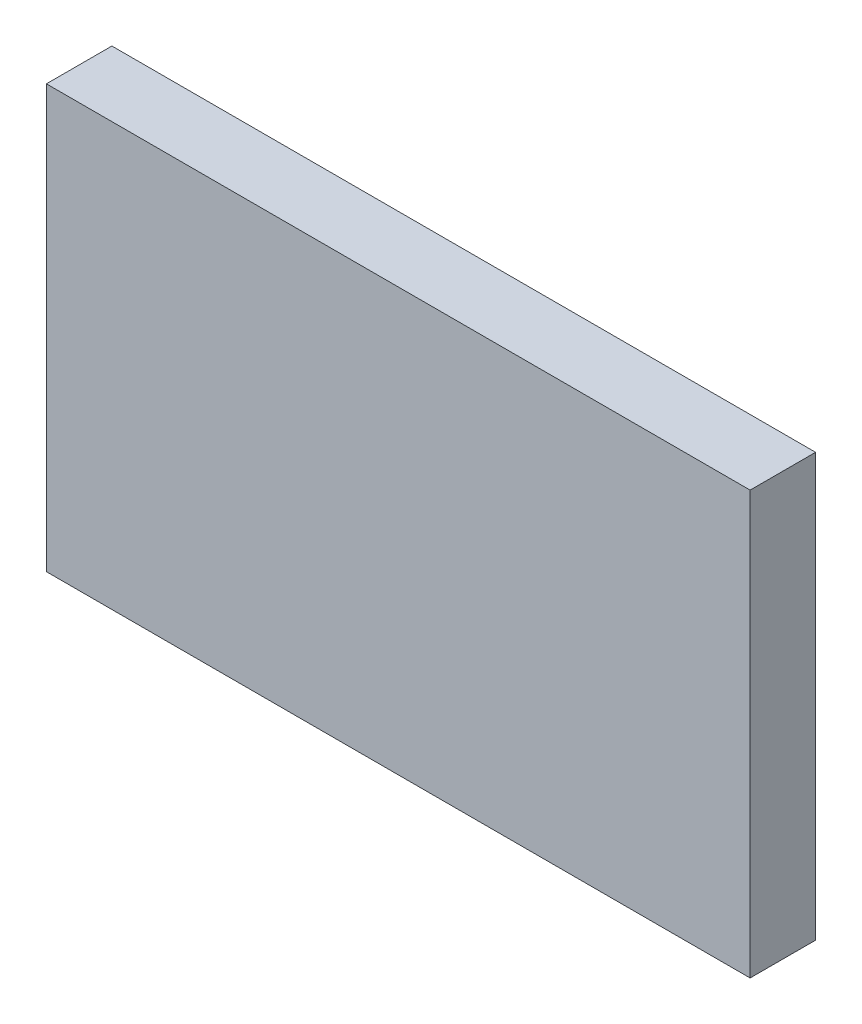
ISO-10303-21;
HEADER;
FILE_DESCRIPTION(('STEP AP214'),'2;1');
FILE_NAME('part.step','',(''),(''),'','','');
FILE_SCHEMA(('AUTOMOTIVE_DESIGN { 1 0 10303 214 1 1 1 1 }'));
ENDSEC;
DATA;
#1=APPLICATION_CONTEXT('core data for automotive mechanical design processes');
#2=APPLICATION_PROTOCOL_DEFINITION('international standard','automotive_design',2000,#1);
#3=PRODUCT_CONTEXT('',#1,'mechanical');
#4=PRODUCT('Part','Part','',(#3));
#5=PRODUCT_RELATED_PRODUCT_CATEGORY('part','',(#4));
#6=PRODUCT_DEFINITION_FORMATION('','',#4);
#7=PRODUCT_DEFINITION_CONTEXT('part definition',#1,'design');
#8=PRODUCT_DEFINITION('design','',#6,#7);
#9=PRODUCT_DEFINITION_SHAPE('','',#8);
#10=(LENGTH_UNIT() NAMED_UNIT(*) SI_UNIT(.MILLI.,.METRE.));
#11=(NAMED_UNIT(*) PLANE_ANGLE_UNIT() SI_UNIT($,.RADIAN.));
#12=(NAMED_UNIT(*) SI_UNIT($,.STERADIAN.) SOLID_ANGLE_UNIT());
#13=UNCERTAINTY_MEASURE_WITH_UNIT(LENGTH_MEASURE(1.E-05),#10,'distance_accuracy_value','');
#14=(GEOMETRIC_REPRESENTATION_CONTEXT(3) GLOBAL_UNCERTAINTY_ASSIGNED_CONTEXT((#13)) GLOBAL_UNIT_ASSIGNED_CONTEXT((#10,
#11,#12)) REPRESENTATION_CONTEXT('',''));
#15=CARTESIAN_POINT('',(0.,0.,0.));
#16=DIRECTION('',(0.,0.,1.));
#17=DIRECTION('',(1.,0.,0.));
#18=AXIS2_PLACEMENT_3D('',#15,#16,#17);
#19=CARTESIAN_POINT('',(-59.2864238582124,30.3230337078652,10.));
#20=DIRECTION('',(1.,0.,0.));
#21=DIRECTION('',(0.,0.,-1.));
#22=AXIS2_PLACEMENT_3D('',#19,#20,#21);
#23=PLANE('',#22);
#24=DIRECTION('',(0.,-1.,0.));
#25=VECTOR('',#24,1.);
#26=CARTESIAN_POINT('',(-59.2864238582124,30.3230337078652,0.));
#27=LINE('',#26,#25);
#28=CARTESIAN_POINT('',(-59.2864238582124,30.3230337078652,0.));
#29=VERTEX_POINT('',#28);
#30=CARTESIAN_POINT('',(-59.2864238582124,-34.2043820224719,0.));
#31=VERTEX_POINT('',#30);
#32=EDGE_CURVE('E96',#29,#31,#27,.T.);
#33=ORIENTED_EDGE('',*,*,#32,.T.);
#34=DIRECTION('',(0.,0.,-1.));
#35=VECTOR('',#34,1.);
#36=CARTESIAN_POINT('',(-59.2864238582124,-34.2043820224719,10.));
#37=LINE('',#36,#35);
#38=CARTESIAN_POINT('',(-59.2864238582124,-34.2043820224719,10.));
#39=VERTEX_POINT('',#38);
#40=EDGE_CURVE('E11',#39,#31,#37,.T.);
#41=ORIENTED_EDGE('',*,*,#40,.F.);
#42=DIRECTION('',(0.,-1.,0.));
#43=VECTOR('',#42,1.);
#44=CARTESIAN_POINT('',(-59.2864238582124,30.3230337078652,10.));
#45=LINE('',#44,#43);
#46=CARTESIAN_POINT('',(-59.2864238582124,30.3230337078652,10.));
#47=VERTEX_POINT('',#46);
#48=EDGE_CURVE('E84',#47,#39,#45,.T.);
#49=ORIENTED_EDGE('',*,*,#48,.F.);
#50=DIRECTION('',(0.,0.,-1.));
#51=VECTOR('',#50,1.);
#52=CARTESIAN_POINT('',(-59.2864238582124,30.3230337078652,10.));
#53=LINE('',#52,#51);
#54=EDGE_CURVE('E92',#47,#29,#53,.T.);
#55=ORIENTED_EDGE('',*,*,#54,.T.);
#56=EDGE_LOOP('',(#33,#41,#49,#55));
#57=FACE_BOUND('',#56,.T.);
#58=ADVANCED_FACE('F33',(#57),#23,.F.);
#59=CARTESIAN_POINT('',(-59.2864238582124,-34.2043820224719,10.));
#60=DIRECTION('',(0.,1.,0.));
#61=DIRECTION('',(0.,0.,1.));
#62=AXIS2_PLACEMENT_3D('',#59,#60,#61);
#63=PLANE('',#62);
#64=DIRECTION('',(1.,0.,0.));
#65=VECTOR('',#64,1.);
#66=CARTESIAN_POINT('',(-59.2864238582124,-34.2043820224719,0.));
#67=LINE('',#66,#65);
#68=CARTESIAN_POINT('',(48.1784076024618,-34.2043820224719,0.));
#69=VERTEX_POINT('',#68);
#70=EDGE_CURVE('E88',#31,#69,#67,.T.);
#71=ORIENTED_EDGE('',*,*,#70,.T.);
#72=DIRECTION('',(0.,0.,-1.));
#73=VECTOR('',#72,1.);
#74=CARTESIAN_POINT('',(48.1784076024618,-34.2043820224719,10.));
#75=LINE('',#74,#73);
#76=CARTESIAN_POINT('',(48.1784076024618,-34.2043820224719,10.));
#77=VERTEX_POINT('',#76);
#78=EDGE_CURVE('E41',#77,#69,#75,.T.);
#79=ORIENTED_EDGE('',*,*,#78,.F.);
#80=DIRECTION('',(1.,0.,0.));
#81=VECTOR('',#80,1.);
#82=CARTESIAN_POINT('',(-59.2864238582124,-34.2043820224719,10.));
#83=LINE('',#82,#81);
#84=EDGE_CURVE('E79',#39,#77,#83,.T.);
#85=ORIENTED_EDGE('',*,*,#84,.F.);
#86=ORIENTED_EDGE('',*,*,#40,.T.);
#87=EDGE_LOOP('',(#71,#79,#85,#86));
#88=FACE_BOUND('',#87,.T.);
#89=ADVANCED_FACE('F87',(#88),#63,.F.);
#90=CARTESIAN_POINT('',(48.1784076024618,30.3230337078652,10.));
#91=DIRECTION('',(-1.,0.,0.));
#92=DIRECTION('',(0.,0.,1.));
#93=AXIS2_PLACEMENT_3D('',#90,#91,#92);
#94=PLANE('',#93);
#95=DIRECTION('',(0.,1.,0.));
#96=VECTOR('',#95,1.);
#97=CARTESIAN_POINT('',(48.1784076024618,30.3230337078652,0.));
#98=LINE('',#97,#96);
#99=CARTESIAN_POINT('',(48.1784076024618,30.3230337078652,0.));
#100=VERTEX_POINT('',#99);
#101=EDGE_CURVE('E66',#69,#100,#98,.T.);
#102=ORIENTED_EDGE('',*,*,#101,.T.);
#103=DIRECTION('',(0.,0.,-1.));
#104=VECTOR('',#103,1.);
#105=CARTESIAN_POINT('',(48.1784076024618,30.3230337078652,10.));
#106=LINE('',#105,#104);
#107=CARTESIAN_POINT('',(48.1784076024618,30.3230337078652,10.));
#108=VERTEX_POINT('',#107);
#109=EDGE_CURVE('E89',#108,#100,#106,.T.);
#110=ORIENTED_EDGE('',*,*,#109,.F.);
#111=DIRECTION('',(0.,1.,0.));
#112=VECTOR('',#111,1.);
#113=CARTESIAN_POINT('',(48.1784076024618,30.3230337078652,10.));
#114=LINE('',#113,#112);
#115=EDGE_CURVE('E82',#77,#108,#114,.T.);
#116=ORIENTED_EDGE('',*,*,#115,.F.);
#117=ORIENTED_EDGE('',*,*,#78,.T.);
#118=EDGE_LOOP('',(#102,#110,#116,#117));
#119=FACE_BOUND('',#118,.T.);
#120=ADVANCED_FACE('F90',(#119),#94,.F.);
#121=CARTESIAN_POINT('',(-59.2864238582124,30.3230337078652,10.));
#122=DIRECTION('',(0.,-1.,0.));
#123=DIRECTION('',(0.,0.,-1.));
#124=AXIS2_PLACEMENT_3D('',#121,#122,#123);
#125=PLANE('',#124);
#126=DIRECTION('',(-1.,0.,0.));
#127=VECTOR('',#126,1.);
#128=CARTESIAN_POINT('',(-59.2864238582124,30.3230337078652,0.));
#129=LINE('',#128,#127);
#130=EDGE_CURVE('E72',#100,#29,#129,.T.);
#131=ORIENTED_EDGE('',*,*,#130,.T.);
#132=ORIENTED_EDGE('',*,*,#54,.F.);
#133=DIRECTION('',(-1.,0.,0.));
#134=VECTOR('',#133,1.);
#135=CARTESIAN_POINT('',(-59.2864238582124,30.3230337078652,10.));
#136=LINE('',#135,#134);
#137=EDGE_CURVE('E49',#108,#47,#136,.T.);
#138=ORIENTED_EDGE('',*,*,#137,.F.);
#139=ORIENTED_EDGE('',*,*,#109,.T.);
#140=EDGE_LOOP('',(#131,#132,#138,#139));
#141=FACE_BOUND('',#140,.T.);
#142=ADVANCED_FACE('F103',(#141),#125,.F.);
#143=CARTESIAN_POINT('',(0.,0.,10.));
#144=DIRECTION('',(0.,0.,1.));
#145=DIRECTION('',(1.,0.,0.));
#146=AXIS2_PLACEMENT_3D('',#143,#144,#145);
#147=PLANE('',#146);
#148=ORIENTED_EDGE('',*,*,#48,.T.);
#149=ORIENTED_EDGE('',*,*,#84,.T.);
#150=ORIENTED_EDGE('',*,*,#115,.T.);
#151=ORIENTED_EDGE('',*,*,#137,.T.);
#152=EDGE_LOOP('',(#148,#149,#150,#151));
#153=FACE_BOUND('',#152,.T.);
#154=ADVANCED_FACE('F80',(#153),#147,.T.);
#155=CARTESIAN_POINT('',(0.,0.,0.));
#156=DIRECTION('',(0.,0.,1.));
#157=DIRECTION('',(1.,0.,0.));
#158=AXIS2_PLACEMENT_3D('',#155,#156,#157);
#159=PLANE('',#158);
#160=ORIENTED_EDGE('',*,*,#32,.F.);
#161=ORIENTED_EDGE('',*,*,#130,.F.);
#162=ORIENTED_EDGE('',*,*,#101,.F.);
#163=ORIENTED_EDGE('',*,*,#70,.F.);
#164=EDGE_LOOP('',(#160,#161,#162,#163));
#165=FACE_BOUND('',#164,.T.);
#166=ADVANCED_FACE('F106',(#165),#159,.F.);
#167=CLOSED_SHELL('',(#58,#89,#120,#142,#154,#166));
#168=MANIFOLD_SOLID_BREP('B2',#167);
#169=ADVANCED_BREP_SHAPE_REPRESENTATION('',(#18,#168),#14);
#170=SHAPE_DEFINITION_REPRESENTATION(#9,#169);
ENDSEC;
END-ISO-10303-21;
